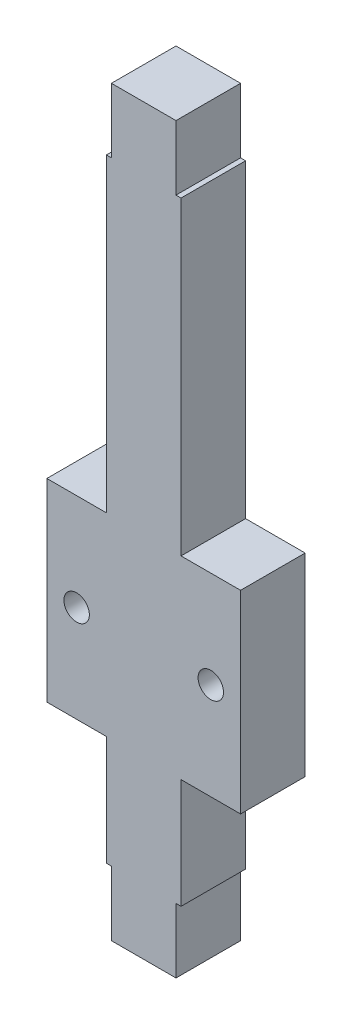
ISO-10303-21;
HEADER;
FILE_DESCRIPTION(('STEP AP214'),'2;1');
FILE_NAME('part.step','',(''),(''),'','','');
FILE_SCHEMA(('AUTOMOTIVE_DESIGN { 1 0 10303 214 1 1 1 1 }'));
ENDSEC;
DATA;
#1=APPLICATION_CONTEXT('core data for automotive mechanical design processes');
#2=APPLICATION_PROTOCOL_DEFINITION('international standard','automotive_design',2000,#1);
#3=PRODUCT_CONTEXT('',#1,'mechanical');
#4=PRODUCT('Part','Part','',(#3));
#5=PRODUCT_RELATED_PRODUCT_CATEGORY('part','',(#4));
#6=PRODUCT_DEFINITION_FORMATION('','',#4);
#7=PRODUCT_DEFINITION_CONTEXT('part definition',#1,'design');
#8=PRODUCT_DEFINITION('design','',#6,#7);
#9=PRODUCT_DEFINITION_SHAPE('','',#8);
#10=(LENGTH_UNIT() NAMED_UNIT(*) SI_UNIT(.MILLI.,.METRE.));
#11=(NAMED_UNIT(*) PLANE_ANGLE_UNIT() SI_UNIT($,.RADIAN.));
#12=(NAMED_UNIT(*) SI_UNIT($,.STERADIAN.) SOLID_ANGLE_UNIT());
#13=UNCERTAINTY_MEASURE_WITH_UNIT(LENGTH_MEASURE(1.E-05),#10,'distance_accuracy_value','');
#14=(GEOMETRIC_REPRESENTATION_CONTEXT(3) GLOBAL_UNCERTAINTY_ASSIGNED_CONTEXT((#13)) GLOBAL_UNIT_ASSIGNED_CONTEXT((#10,
#11,#12)) REPRESENTATION_CONTEXT('',''));
#15=CARTESIAN_POINT('',(0.,0.,0.));
#16=DIRECTION('',(0.,0.,1.));
#17=DIRECTION('',(1.,0.,0.));
#18=AXIS2_PLACEMENT_3D('',#15,#16,#17);
#19=CARTESIAN_POINT('',(0.,0.,6.35));
#20=DIRECTION('',(0.,-1.,0.));
#21=DIRECTION('',(0.,0.,-1.));
#22=AXIS2_PLACEMENT_3D('',#19,#20,#21);
#23=PLANE('',#22);
#24=DIRECTION('',(-1.,0.,0.));
#25=VECTOR('',#24,1.);
#26=CARTESIAN_POINT('',(0.,0.,0.));
#27=LINE('',#26,#25);
#28=CARTESIAN_POINT('',(6.8453,0.,0.));
#29=VERTEX_POINT('',#28);
#30=CARTESIAN_POINT('',(6.35,0.,0.));
#31=VERTEX_POINT('',#30);
#32=EDGE_CURVE('E200',#29,#31,#27,.T.);
#33=ORIENTED_EDGE('',*,*,#32,.F.);
#34=DIRECTION('',(0.,0.,-1.));
#35=VECTOR('',#34,1.);
#36=CARTESIAN_POINT('',(6.8453,0.,6.35));
#37=LINE('',#36,#35);
#38=CARTESIAN_POINT('',(6.8453,0.,6.35));
#39=VERTEX_POINT('',#38);
#40=EDGE_CURVE('E11',#39,#29,#37,.T.);
#41=ORIENTED_EDGE('',*,*,#40,.F.);
#42=DIRECTION('',(-1.,0.,0.));
#43=VECTOR('',#42,1.);
#44=CARTESIAN_POINT('',(0.,0.,6.35));
#45=LINE('',#44,#43);
#46=CARTESIAN_POINT('',(6.35,0.,6.35));
#47=VERTEX_POINT('',#46);
#48=EDGE_CURVE('E253',#39,#47,#45,.T.);
#49=ORIENTED_EDGE('',*,*,#48,.T.);
#50=DIRECTION('',(0.,0.,-1.));
#51=VECTOR('',#50,1.);
#52=CARTESIAN_POINT('',(6.35,0.,6.35));
#53=LINE('',#52,#51);
#54=EDGE_CURVE('E121',#47,#31,#53,.T.);
#55=ORIENTED_EDGE('',*,*,#54,.T.);
#56=EDGE_LOOP('',(#33,#41,#49,#55));
#57=FACE_BOUND('',#56,.T.);
#58=ADVANCED_FACE('F35',(#57),#23,.T.);
#59=CARTESIAN_POINT('',(6.8453,0.,6.35));
#60=DIRECTION('',(1.,0.,0.));
#61=DIRECTION('',(0.,0.,-1.));
#62=AXIS2_PLACEMENT_3D('',#59,#60,#61);
#63=PLANE('',#62);
#64=DIRECTION('',(0.,-1.,0.));
#65=VECTOR('',#64,1.);
#66=CARTESIAN_POINT('',(6.8453,0.,0.));
#67=LINE('',#66,#65);
#68=CARTESIAN_POINT('',(6.8453,10.795,0.));
#69=VERTEX_POINT('',#68);
#70=EDGE_CURVE('E203',#69,#29,#67,.T.);
#71=ORIENTED_EDGE('',*,*,#70,.F.);
#72=DIRECTION('',(0.,0.,-1.));
#73=VECTOR('',#72,1.);
#74=CARTESIAN_POINT('',(6.8453,10.795,6.35));
#75=LINE('',#74,#73);
#76=CARTESIAN_POINT('',(6.8453,10.795,6.35));
#77=VERTEX_POINT('',#76);
#78=EDGE_CURVE('E43',#77,#69,#75,.T.);
#79=ORIENTED_EDGE('',*,*,#78,.F.);
#80=DIRECTION('',(0.,-1.,0.));
#81=VECTOR('',#80,1.);
#82=CARTESIAN_POINT('',(6.8453,0.,6.35));
#83=LINE('',#82,#81);
#84=EDGE_CURVE('E301',#77,#39,#83,.T.);
#85=ORIENTED_EDGE('',*,*,#84,.T.);
#86=ORIENTED_EDGE('',*,*,#40,.T.);
#87=EDGE_LOOP('',(#71,#79,#85,#86));
#88=FACE_BOUND('',#87,.T.);
#89=ADVANCED_FACE('F300',(#88),#63,.T.);
#90=CARTESIAN_POINT('',(0.,10.795,6.35));
#91=DIRECTION('',(0.,1.,0.));
#92=DIRECTION('',(-1.,0.,0.));
#93=AXIS2_PLACEMENT_3D('',#90,#91,#92);
#94=PLANE('',#93);
#95=DIRECTION('',(1.,0.,0.));
#96=VECTOR('',#95,1.);
#97=CARTESIAN_POINT('',(0.,10.795,0.));
#98=LINE('',#97,#96);
#99=CARTESIAN_POINT('',(12.7,10.795,0.));
#100=VERTEX_POINT('',#99);
#101=EDGE_CURVE('E207',#69,#100,#98,.T.);
#102=ORIENTED_EDGE('',*,*,#101,.T.);
#103=DIRECTION('',(0.,0.,-1.));
#104=VECTOR('',#103,1.);
#105=CARTESIAN_POINT('',(12.7,10.795,6.35));
#106=LINE('',#105,#104);
#107=CARTESIAN_POINT('',(12.7,10.795,6.35));
#108=VERTEX_POINT('',#107);
#109=EDGE_CURVE('E286',#108,#100,#106,.T.);
#110=ORIENTED_EDGE('',*,*,#109,.F.);
#111=DIRECTION('',(1.,0.,0.));
#112=VECTOR('',#111,1.);
#113=CARTESIAN_POINT('',(0.,10.795,6.35));
#114=LINE('',#113,#112);
#115=EDGE_CURVE('E292',#77,#108,#114,.T.);
#116=ORIENTED_EDGE('',*,*,#115,.F.);
#117=ORIENTED_EDGE('',*,*,#78,.T.);
#118=EDGE_LOOP('',(#102,#110,#116,#117));
#119=FACE_BOUND('',#118,.T.);
#120=ADVANCED_FACE('F290',(#119),#94,.F.);
#121=CARTESIAN_POINT('',(12.7,0.,6.35));
#122=DIRECTION('',(1.,0.,0.));
#123=DIRECTION('',(0.,1.,0.));
#124=AXIS2_PLACEMENT_3D('',#121,#122,#123);
#125=PLANE('',#124);
#126=DIRECTION('',(0.,-1.,0.));
#127=VECTOR('',#126,1.);
#128=CARTESIAN_POINT('',(12.7,0.,0.));
#129=LINE('',#128,#127);
#130=CARTESIAN_POINT('',(12.7,29.845,0.));
#131=VERTEX_POINT('',#130);
#132=EDGE_CURVE('E210',#131,#100,#129,.T.);
#133=ORIENTED_EDGE('',*,*,#132,.F.);
#134=DIRECTION('',(0.,0.,-1.));
#135=VECTOR('',#134,1.);
#136=CARTESIAN_POINT('',(12.7,29.845,6.35));
#137=LINE('',#136,#135);
#138=CARTESIAN_POINT('',(12.7,29.845,6.35));
#139=VERTEX_POINT('',#138);
#140=EDGE_CURVE('E284',#139,#131,#137,.T.);
#141=ORIENTED_EDGE('',*,*,#140,.F.);
#142=DIRECTION('',(0.,-1.,0.));
#143=VECTOR('',#142,1.);
#144=CARTESIAN_POINT('',(12.7,0.,6.35));
#145=LINE('',#144,#143);
#146=EDGE_CURVE('E312',#139,#108,#145,.T.);
#147=ORIENTED_EDGE('',*,*,#146,.T.);
#148=ORIENTED_EDGE('',*,*,#109,.T.);
#149=EDGE_LOOP('',(#133,#141,#147,#148));
#150=FACE_BOUND('',#149,.T.);
#151=ADVANCED_FACE('F400',(#150),#125,.T.);
#152=CARTESIAN_POINT('',(0.,29.845,6.35));
#153=DIRECTION('',(0.,1.,0.));
#154=DIRECTION('',(0.,0.,1.));
#155=AXIS2_PLACEMENT_3D('',#152,#153,#154);
#156=PLANE('',#155);
#157=DIRECTION('',(1.,0.,0.));
#158=VECTOR('',#157,1.);
#159=CARTESIAN_POINT('',(0.,29.845,0.));
#160=LINE('',#159,#158);
#161=CARTESIAN_POINT('',(6.8453,29.845,0.));
#162=VERTEX_POINT('',#161);
#163=EDGE_CURVE('E213',#162,#131,#160,.T.);
#164=ORIENTED_EDGE('',*,*,#163,.F.);
#165=DIRECTION('',(0.,0.,-1.));
#166=VECTOR('',#165,1.);
#167=CARTESIAN_POINT('',(6.8453,29.845,6.35));
#168=LINE('',#167,#166);
#169=CARTESIAN_POINT('',(6.8453,29.845,6.35));
#170=VERTEX_POINT('',#169);
#171=EDGE_CURVE('E282',#170,#162,#168,.T.);
#172=ORIENTED_EDGE('',*,*,#171,.F.);
#173=DIRECTION('',(1.,0.,0.));
#174=VECTOR('',#173,1.);
#175=CARTESIAN_POINT('',(0.,29.845,6.35));
#176=LINE('',#175,#174);
#177=EDGE_CURVE('E315',#170,#139,#176,.T.);
#178=ORIENTED_EDGE('',*,*,#177,.T.);
#179=ORIENTED_EDGE('',*,*,#140,.T.);
#180=EDGE_LOOP('',(#164,#172,#178,#179));
#181=FACE_BOUND('',#180,.T.);
#182=ADVANCED_FACE('F397',(#181),#156,.T.);
#183=CARTESIAN_POINT('',(6.8453,0.,6.35));
#184=DIRECTION('',(1.,0.,0.));
#185=DIRECTION('',(0.,0.,-1.));
#186=AXIS2_PLACEMENT_3D('',#183,#184,#185);
#187=PLANE('',#186);
#188=DIRECTION('',(0.,-1.,0.));
#189=VECTOR('',#188,1.);
#190=CARTESIAN_POINT('',(6.8453,0.,0.));
#191=LINE('',#190,#189);
#192=CARTESIAN_POINT('',(6.8453,60.325,0.));
#193=VERTEX_POINT('',#192);
#194=EDGE_CURVE('E216',#193,#162,#191,.T.);
#195=ORIENTED_EDGE('',*,*,#194,.F.);
#196=DIRECTION('',(0.,0.,-1.));
#197=VECTOR('',#196,1.);
#198=CARTESIAN_POINT('',(6.8453,60.325,6.35));
#199=LINE('',#198,#197);
#200=CARTESIAN_POINT('',(6.8453,60.325,6.35));
#201=VERTEX_POINT('',#200);
#202=EDGE_CURVE('E280',#201,#193,#199,.T.);
#203=ORIENTED_EDGE('',*,*,#202,.F.);
#204=DIRECTION('',(0.,-1.,0.));
#205=VECTOR('',#204,1.);
#206=CARTESIAN_POINT('',(6.8453,0.,6.35));
#207=LINE('',#206,#205);
#208=EDGE_CURVE('E318',#201,#170,#207,.T.);
#209=ORIENTED_EDGE('',*,*,#208,.T.);
#210=ORIENTED_EDGE('',*,*,#171,.T.);
#211=EDGE_LOOP('',(#195,#203,#209,#210));
#212=FACE_BOUND('',#211,.T.);
#213=ADVANCED_FACE('F393',(#212),#187,.T.);
#214=CARTESIAN_POINT('',(8.45121693424602E-13,60.3250000000001,6.35));
#215=DIRECTION('',(0.,1.,0.));
#216=DIRECTION('',(-1.,0.,0.));
#217=AXIS2_PLACEMENT_3D('',#214,#215,#216);
#218=PLANE('',#217);
#219=DIRECTION('',(1.,0.,0.));
#220=VECTOR('',#219,1.);
#221=CARTESIAN_POINT('',(8.45121693424602E-13,60.3250000000001,0.));
#222=LINE('',#221,#220);
#223=CARTESIAN_POINT('',(6.35,60.325,0.));
#224=VERTEX_POINT('',#223);
#225=EDGE_CURVE('E219',#224,#193,#222,.T.);
#226=ORIENTED_EDGE('',*,*,#225,.F.);
#227=DIRECTION('',(0.,0.,-1.));
#228=VECTOR('',#227,1.);
#229=CARTESIAN_POINT('',(6.35,60.325,6.35));
#230=LINE('',#229,#228);
#231=CARTESIAN_POINT('',(6.35,60.325,6.35));
#232=VERTEX_POINT('',#231);
#233=EDGE_CURVE('E278',#232,#224,#230,.T.);
#234=ORIENTED_EDGE('',*,*,#233,.F.);
#235=DIRECTION('',(1.,0.,0.));
#236=VECTOR('',#235,1.);
#237=CARTESIAN_POINT('',(8.45121693424602E-13,60.3250000000001,6.35));
#238=LINE('',#237,#236);
#239=EDGE_CURVE('E321',#232,#201,#238,.T.);
#240=ORIENTED_EDGE('',*,*,#239,.T.);
#241=ORIENTED_EDGE('',*,*,#202,.T.);
#242=EDGE_LOOP('',(#226,#234,#240,#241));
#243=FACE_BOUND('',#242,.T.);
#244=ADVANCED_FACE('F389',(#243),#218,.T.);
#245=CARTESIAN_POINT('',(6.35,0.,6.35));
#246=DIRECTION('',(1.,0.,0.));
#247=DIRECTION('',(0.,0.,-1.));
#248=AXIS2_PLACEMENT_3D('',#245,#246,#247);
#249=PLANE('',#248);
#250=DIRECTION('',(0.,-1.,0.));
#251=VECTOR('',#250,1.);
#252=CARTESIAN_POINT('',(6.35,0.,0.));
#253=LINE('',#252,#251);
#254=CARTESIAN_POINT('',(6.35,66.675,0.));
#255=VERTEX_POINT('',#254);
#256=EDGE_CURVE('E222',#255,#224,#253,.T.);
#257=ORIENTED_EDGE('',*,*,#256,.F.);
#258=DIRECTION('',(0.,0.,-1.));
#259=VECTOR('',#258,1.);
#260=CARTESIAN_POINT('',(6.35,66.675,6.35));
#261=LINE('',#260,#259);
#262=CARTESIAN_POINT('',(6.35,66.675,6.35));
#263=VERTEX_POINT('',#262);
#264=EDGE_CURVE('E276',#263,#255,#261,.T.);
#265=ORIENTED_EDGE('',*,*,#264,.F.);
#266=DIRECTION('',(0.,-1.,0.));
#267=VECTOR('',#266,1.);
#268=CARTESIAN_POINT('',(6.35,0.,6.35));
#269=LINE('',#268,#267);
#270=EDGE_CURVE('E324',#263,#232,#269,.T.);
#271=ORIENTED_EDGE('',*,*,#270,.T.);
#272=ORIENTED_EDGE('',*,*,#233,.T.);
#273=EDGE_LOOP('',(#257,#265,#271,#272));
#274=FACE_BOUND('',#273,.T.);
#275=ADVANCED_FACE('F385',(#274),#249,.T.);
#276=CARTESIAN_POINT('',(0.,66.675,6.35));
#277=DIRECTION('',(0.,1.,0.));
#278=DIRECTION('',(0.,0.,1.));
#279=AXIS2_PLACEMENT_3D('',#276,#277,#278);
#280=PLANE('',#279);
#281=DIRECTION('',(1.,0.,0.));
#282=VECTOR('',#281,1.);
#283=CARTESIAN_POINT('',(0.,66.675,0.));
#284=LINE('',#283,#282);
#285=CARTESIAN_POINT('',(0.,66.675,0.));
#286=VERTEX_POINT('',#285);
#287=EDGE_CURVE('E225',#286,#255,#284,.T.);
#288=ORIENTED_EDGE('',*,*,#287,.F.);
#289=DIRECTION('',(0.,0.,-1.));
#290=VECTOR('',#289,1.);
#291=CARTESIAN_POINT('',(0.,66.675,6.35));
#292=LINE('',#291,#290);
#293=CARTESIAN_POINT('',(0.,66.675,6.35));
#294=VERTEX_POINT('',#293);
#295=EDGE_CURVE('E274',#294,#286,#292,.T.);
#296=ORIENTED_EDGE('',*,*,#295,.F.);
#297=DIRECTION('',(1.,0.,0.));
#298=VECTOR('',#297,1.);
#299=CARTESIAN_POINT('',(0.,66.675,6.35));
#300=LINE('',#299,#298);
#301=EDGE_CURVE('E327',#294,#263,#300,.T.);
#302=ORIENTED_EDGE('',*,*,#301,.T.);
#303=ORIENTED_EDGE('',*,*,#264,.T.);
#304=EDGE_LOOP('',(#288,#296,#302,#303));
#305=FACE_BOUND('',#304,.T.);
#306=ADVANCED_FACE('F379',(#305),#280,.T.);
#307=CARTESIAN_POINT('',(0.,0.,6.35));
#308=DIRECTION('',(1.,0.,0.));
#309=DIRECTION('',(0.,0.,-1.));
#310=AXIS2_PLACEMENT_3D('',#307,#308,#309);
#311=PLANE('',#310);
#312=DIRECTION('',(0.,-1.,0.));
#313=VECTOR('',#312,1.);
#314=CARTESIAN_POINT('',(0.,0.,0.));
#315=LINE('',#314,#313);
#316=CARTESIAN_POINT('',(0.,60.325,0.));
#317=VERTEX_POINT('',#316);
#318=EDGE_CURVE('E228',#286,#317,#315,.T.);
#319=ORIENTED_EDGE('',*,*,#318,.T.);
#320=DIRECTION('',(0.,0.,-1.));
#321=VECTOR('',#320,1.);
#322=CARTESIAN_POINT('',(0.,60.325,6.35));
#323=LINE('',#322,#321);
#324=CARTESIAN_POINT('',(0.,60.325,6.35));
#325=VERTEX_POINT('',#324);
#326=EDGE_CURVE('E272',#325,#317,#323,.T.);
#327=ORIENTED_EDGE('',*,*,#326,.F.);
#328=DIRECTION('',(0.,-1.,0.));
#329=VECTOR('',#328,1.);
#330=CARTESIAN_POINT('',(0.,0.,6.35));
#331=LINE('',#330,#329);
#332=EDGE_CURVE('E330',#294,#325,#331,.T.);
#333=ORIENTED_EDGE('',*,*,#332,.F.);
#334=ORIENTED_EDGE('',*,*,#295,.T.);
#335=EDGE_LOOP('',(#319,#327,#333,#334));
#336=FACE_BOUND('',#335,.T.);
#337=ADVANCED_FACE('F401',(#336),#311,.F.);
#338=CARTESIAN_POINT('',(0.,60.325,6.35));
#339=DIRECTION('',(0.,1.,0.));
#340=DIRECTION('',(0.,0.,1.));
#341=AXIS2_PLACEMENT_3D('',#338,#339,#340);
#342=PLANE('',#341);
#343=DIRECTION('',(1.,0.,0.));
#344=VECTOR('',#343,1.);
#345=CARTESIAN_POINT('',(0.,60.325,0.));
#346=LINE('',#345,#344);
#347=CARTESIAN_POINT('',(-0.495299999999999,60.325,0.));
#348=VERTEX_POINT('',#347);
#349=EDGE_CURVE('E231',#348,#317,#346,.T.);
#350=ORIENTED_EDGE('',*,*,#349,.F.);
#351=DIRECTION('',(0.,0.,-1.));
#352=VECTOR('',#351,1.);
#353=CARTESIAN_POINT('',(-0.495299999999999,60.325,6.35));
#354=LINE('',#353,#352);
#355=CARTESIAN_POINT('',(-0.495299999999999,60.325,6.35));
#356=VERTEX_POINT('',#355);
#357=EDGE_CURVE('E270',#356,#348,#354,.T.);
#358=ORIENTED_EDGE('',*,*,#357,.F.);
#359=DIRECTION('',(1.,0.,0.));
#360=VECTOR('',#359,1.);
#361=CARTESIAN_POINT('',(0.,60.325,6.35));
#362=LINE('',#361,#360);
#363=EDGE_CURVE('E332',#356,#325,#362,.T.);
#364=ORIENTED_EDGE('',*,*,#363,.T.);
#365=ORIENTED_EDGE('',*,*,#326,.T.);
#366=EDGE_LOOP('',(#350,#358,#364,#365));
#367=FACE_BOUND('',#366,.T.);
#368=ADVANCED_FACE('F373',(#367),#342,.T.);
#369=CARTESIAN_POINT('',(-0.495299999999999,0.,6.35));
#370=DIRECTION('',(1.,0.,0.));
#371=DIRECTION('',(0.,0.,-1.));
#372=AXIS2_PLACEMENT_3D('',#369,#370,#371);
#373=PLANE('',#372);
#374=DIRECTION('',(0.,-1.,0.));
#375=VECTOR('',#374,1.);
#376=CARTESIAN_POINT('',(-0.495299999999999,0.,0.));
#377=LINE('',#376,#375);
#378=CARTESIAN_POINT('',(-0.495299999999999,29.845,0.));
#379=VERTEX_POINT('',#378);
#380=EDGE_CURVE('E234',#348,#379,#377,.T.);
#381=ORIENTED_EDGE('',*,*,#380,.T.);
#382=DIRECTION('',(0.,0.,-1.));
#383=VECTOR('',#382,1.);
#384=CARTESIAN_POINT('',(-0.495299999999999,29.845,6.35));
#385=LINE('',#384,#383);
#386=CARTESIAN_POINT('',(-0.495299999999999,29.845,6.35));
#387=VERTEX_POINT('',#386);
#388=EDGE_CURVE('E267',#387,#379,#385,.T.);
#389=ORIENTED_EDGE('',*,*,#388,.F.);
#390=DIRECTION('',(0.,-1.,0.));
#391=VECTOR('',#390,1.);
#392=CARTESIAN_POINT('',(-0.495299999999999,0.,6.35));
#393=LINE('',#392,#391);
#394=EDGE_CURVE('E335',#356,#387,#393,.T.);
#395=ORIENTED_EDGE('',*,*,#394,.F.);
#396=ORIENTED_EDGE('',*,*,#357,.T.);
#397=EDGE_LOOP('',(#381,#389,#395,#396));
#398=FACE_BOUND('',#397,.T.);
#399=ADVANCED_FACE('F370',(#398),#373,.F.);
#400=CARTESIAN_POINT('',(0.,29.845,6.35));
#401=DIRECTION('',(0.,-1.,0.));
#402=DIRECTION('',(0.,0.,-1.));
#403=AXIS2_PLACEMENT_3D('',#400,#401,#402);
#404=PLANE('',#403);
#405=DIRECTION('',(-1.,0.,0.));
#406=VECTOR('',#405,1.);
#407=CARTESIAN_POINT('',(0.,29.845,0.));
#408=LINE('',#407,#406);
#409=CARTESIAN_POINT('',(-6.35,29.845,0.));
#410=VERTEX_POINT('',#409);
#411=EDGE_CURVE('E236',#379,#410,#408,.T.);
#412=ORIENTED_EDGE('',*,*,#411,.T.);
#413=DIRECTION('',(0.,0.,-1.));
#414=VECTOR('',#413,1.);
#415=CARTESIAN_POINT('',(-6.35,29.845,6.35));
#416=LINE('',#415,#414);
#417=CARTESIAN_POINT('',(-6.35,29.845,6.35));
#418=VERTEX_POINT('',#417);
#419=EDGE_CURVE('E264',#418,#410,#416,.T.);
#420=ORIENTED_EDGE('',*,*,#419,.F.);
#421=DIRECTION('',(-1.,0.,0.));
#422=VECTOR('',#421,1.);
#423=CARTESIAN_POINT('',(0.,29.845,6.35));
#424=LINE('',#423,#422);
#425=EDGE_CURVE('E337',#387,#418,#424,.T.);
#426=ORIENTED_EDGE('',*,*,#425,.F.);
#427=ORIENTED_EDGE('',*,*,#388,.T.);
#428=EDGE_LOOP('',(#412,#420,#426,#427));
#429=FACE_BOUND('',#428,.T.);
#430=ADVANCED_FACE('F365',(#429),#404,.F.);
#431=CARTESIAN_POINT('',(-6.34999999999999,0.,6.35));
#432=DIRECTION('',(1.,0.,0.));
#433=DIRECTION('',(0.,1.,0.));
#434=AXIS2_PLACEMENT_3D('',#431,#432,#433);
#435=PLANE('',#434);
#436=DIRECTION('',(0.,-1.,0.));
#437=VECTOR('',#436,1.);
#438=CARTESIAN_POINT('',(-6.34999999999999,0.,0.));
#439=LINE('',#438,#437);
#440=CARTESIAN_POINT('',(-6.35,10.795,0.));
#441=VERTEX_POINT('',#440);
#442=EDGE_CURVE('E238',#410,#441,#439,.T.);
#443=ORIENTED_EDGE('',*,*,#442,.T.);
#444=DIRECTION('',(0.,0.,-1.));
#445=VECTOR('',#444,1.);
#446=CARTESIAN_POINT('',(-6.35,10.795,6.35));
#447=LINE('',#446,#445);
#448=CARTESIAN_POINT('',(-6.35,10.795,6.35));
#449=VERTEX_POINT('',#448);
#450=EDGE_CURVE('E262',#449,#441,#447,.T.);
#451=ORIENTED_EDGE('',*,*,#450,.F.);
#452=DIRECTION('',(0.,-1.,0.));
#453=VECTOR('',#452,1.);
#454=CARTESIAN_POINT('',(-6.34999999999999,0.,6.35));
#455=LINE('',#454,#453);
#456=EDGE_CURVE('E339',#418,#449,#455,.T.);
#457=ORIENTED_EDGE('',*,*,#456,.F.);
#458=ORIENTED_EDGE('',*,*,#419,.T.);
#459=EDGE_LOOP('',(#443,#451,#457,#458));
#460=FACE_BOUND('',#459,.T.);
#461=ADVANCED_FACE('F359',(#460),#435,.F.);
#462=CARTESIAN_POINT('',(0.,10.795,6.35));
#463=DIRECTION('',(0.,-1.,0.));
#464=DIRECTION('',(1.,0.,0.));
#465=AXIS2_PLACEMENT_3D('',#462,#463,#464);
#466=PLANE('',#465);
#467=DIRECTION('',(-1.,0.,0.));
#468=VECTOR('',#467,1.);
#469=CARTESIAN_POINT('',(0.,10.795,0.));
#470=LINE('',#469,#468);
#471=CARTESIAN_POINT('',(-0.495299999999999,10.795,0.));
#472=VERTEX_POINT('',#471);
#473=EDGE_CURVE('E241',#472,#441,#470,.T.);
#474=ORIENTED_EDGE('',*,*,#473,.F.);
#475=DIRECTION('',(0.,0.,-1.));
#476=VECTOR('',#475,1.);
#477=CARTESIAN_POINT('',(-0.495299999999999,10.795,6.35));
#478=LINE('',#477,#476);
#479=CARTESIAN_POINT('',(-0.495299999999999,10.795,6.35));
#480=VERTEX_POINT('',#479);
#481=EDGE_CURVE('E260',#480,#472,#478,.T.);
#482=ORIENTED_EDGE('',*,*,#481,.F.);
#483=DIRECTION('',(-1.,0.,0.));
#484=VECTOR('',#483,1.);
#485=CARTESIAN_POINT('',(0.,10.795,6.35));
#486=LINE('',#485,#484);
#487=EDGE_CURVE('E341',#480,#449,#486,.T.);
#488=ORIENTED_EDGE('',*,*,#487,.T.);
#489=ORIENTED_EDGE('',*,*,#450,.T.);
#490=EDGE_LOOP('',(#474,#482,#488,#489));
#491=FACE_BOUND('',#490,.T.);
#492=ADVANCED_FACE('F355',(#491),#466,.T.);
#493=CARTESIAN_POINT('',(-0.495299999999999,0.,6.35));
#494=DIRECTION('',(1.,0.,0.));
#495=DIRECTION('',(0.,0.,-1.));
#496=AXIS2_PLACEMENT_3D('',#493,#494,#495);
#497=PLANE('',#496);
#498=DIRECTION('',(0.,-1.,0.));
#499=VECTOR('',#498,1.);
#500=CARTESIAN_POINT('',(-0.495299999999999,0.,0.));
#501=LINE('',#500,#499);
#502=CARTESIAN_POINT('',(-0.495299999999999,0.,0.));
#503=VERTEX_POINT('',#502);
#504=EDGE_CURVE('E244',#472,#503,#501,.T.);
#505=ORIENTED_EDGE('',*,*,#504,.T.);
#506=DIRECTION('',(0.,0.,-1.));
#507=VECTOR('',#506,1.);
#508=CARTESIAN_POINT('',(-0.495299999999999,0.,6.35));
#509=LINE('',#508,#507);
#510=CARTESIAN_POINT('',(-0.495299999999999,0.,6.35));
#511=VERTEX_POINT('',#510);
#512=EDGE_CURVE('E257',#511,#503,#509,.T.);
#513=ORIENTED_EDGE('',*,*,#512,.F.);
#514=DIRECTION('',(0.,-1.,0.));
#515=VECTOR('',#514,1.);
#516=CARTESIAN_POINT('',(-0.495299999999999,0.,6.35));
#517=LINE('',#516,#515);
#518=EDGE_CURVE('E195',#480,#511,#517,.T.);
#519=ORIENTED_EDGE('',*,*,#518,.F.);
#520=ORIENTED_EDGE('',*,*,#481,.T.);
#521=EDGE_LOOP('',(#505,#513,#519,#520));
#522=FACE_BOUND('',#521,.T.);
#523=ADVANCED_FACE('F347',(#522),#497,.F.);
#524=CARTESIAN_POINT('',(0.,0.,6.35));
#525=DIRECTION('',(0.,1.,0.));
#526=DIRECTION('',(0.,0.,1.));
#527=AXIS2_PLACEMENT_3D('',#524,#525,#526);
#528=PLANE('',#527);
#529=DIRECTION('',(1.,0.,0.));
#530=VECTOR('',#529,1.);
#531=CARTESIAN_POINT('',(0.,0.,0.));
#532=LINE('',#531,#530);
#533=CARTESIAN_POINT('',(0.,0.,0.));
#534=VERTEX_POINT('',#533);
#535=EDGE_CURVE('E246',#503,#534,#532,.T.);
#536=ORIENTED_EDGE('',*,*,#535,.T.);
#537=DIRECTION('',(0.,0.,-1.));
#538=VECTOR('',#537,1.);
#539=CARTESIAN_POINT('',(0.,0.,6.35));
#540=LINE('',#539,#538);
#541=CARTESIAN_POINT('',(0.,0.,6.35));
#542=VERTEX_POINT('',#541);
#543=EDGE_CURVE('E184',#542,#534,#540,.T.);
#544=ORIENTED_EDGE('',*,*,#543,.F.);
#545=DIRECTION('',(1.,0.,0.));
#546=VECTOR('',#545,1.);
#547=CARTESIAN_POINT('',(0.,0.,6.35));
#548=LINE('',#547,#546);
#549=EDGE_CURVE('E192',#511,#542,#548,.T.);
#550=ORIENTED_EDGE('',*,*,#549,.F.);
#551=ORIENTED_EDGE('',*,*,#512,.T.);
#552=EDGE_LOOP('',(#536,#544,#550,#551));
#553=FACE_BOUND('',#552,.T.);
#554=ADVANCED_FACE('F351',(#553),#528,.F.);
#555=CARTESIAN_POINT('',(0.,0.,6.35));
#556=DIRECTION('',(-1.,0.,0.));
#557=DIRECTION('',(0.,0.,1.));
#558=AXIS2_PLACEMENT_3D('',#555,#556,#557);
#559=PLANE('',#558);
#560=DIRECTION('',(0.,1.,0.));
#561=VECTOR('',#560,1.);
#562=CARTESIAN_POINT('',(0.,0.,0.));
#563=LINE('',#562,#561);
#564=CARTESIAN_POINT('',(0.,-6.34999999999999,0.));
#565=VERTEX_POINT('',#564);
#566=EDGE_CURVE('E183',#565,#534,#563,.T.);
#567=ORIENTED_EDGE('',*,*,#566,.F.);
#568=DIRECTION('',(0.,0.,-1.));
#569=VECTOR('',#568,1.);
#570=CARTESIAN_POINT('',(0.,-6.34999999999999,6.35));
#571=LINE('',#570,#569);
#572=CARTESIAN_POINT('',(0.,-6.34999999999999,6.35));
#573=VERTEX_POINT('',#572);
#574=EDGE_CURVE('E177',#573,#565,#571,.T.);
#575=ORIENTED_EDGE('',*,*,#574,.F.);
#576=DIRECTION('',(0.,1.,0.));
#577=VECTOR('',#576,1.);
#578=CARTESIAN_POINT('',(0.,0.,6.35));
#579=LINE('',#578,#577);
#580=EDGE_CURVE('E181',#573,#542,#579,.T.);
#581=ORIENTED_EDGE('',*,*,#580,.T.);
#582=ORIENTED_EDGE('',*,*,#543,.T.);
#583=EDGE_LOOP('',(#567,#575,#581,#582));
#584=FACE_BOUND('',#583,.T.);
#585=ADVANCED_FACE('F179',(#584),#559,.T.);
#586=CARTESIAN_POINT('',(0.,-6.34999999999999,6.35));
#587=DIRECTION('',(0.,1.,0.));
#588=DIRECTION('',(0.,0.,1.));
#589=AXIS2_PLACEMENT_3D('',#586,#587,#588);
#590=PLANE('',#589);
#591=DIRECTION('',(1.,0.,0.));
#592=VECTOR('',#591,1.);
#593=CARTESIAN_POINT('',(0.,-6.34999999999999,0.));
#594=LINE('',#593,#592);
#595=CARTESIAN_POINT('',(6.35,-6.34999999999999,0.));
#596=VERTEX_POINT('',#595);
#597=EDGE_CURVE('E114',#565,#596,#594,.T.);
#598=ORIENTED_EDGE('',*,*,#597,.T.);
#599=DIRECTION('',(0.,0.,-1.));
#600=VECTOR('',#599,1.);
#601=CARTESIAN_POINT('',(6.35,-6.34999999999999,6.35));
#602=LINE('',#601,#600);
#603=CARTESIAN_POINT('',(6.35,-6.34999999999999,6.35));
#604=VERTEX_POINT('',#603);
#605=EDGE_CURVE('E185',#604,#596,#602,.T.);
#606=ORIENTED_EDGE('',*,*,#605,.F.);
#607=DIRECTION('',(1.,0.,0.));
#608=VECTOR('',#607,1.);
#609=CARTESIAN_POINT('',(0.,-6.34999999999999,6.35));
#610=LINE('',#609,#608);
#611=EDGE_CURVE('E187',#573,#604,#610,.T.);
#612=ORIENTED_EDGE('',*,*,#611,.F.);
#613=ORIENTED_EDGE('',*,*,#574,.T.);
#614=EDGE_LOOP('',(#598,#606,#612,#613));
#615=FACE_BOUND('',#614,.T.);
#616=ADVANCED_FACE('F188',(#615),#590,.F.);
#617=CARTESIAN_POINT('',(6.35,0.,6.35));
#618=DIRECTION('',(-1.,0.,0.));
#619=DIRECTION('',(0.,0.,1.));
#620=AXIS2_PLACEMENT_3D('',#617,#618,#619);
#621=PLANE('',#620);
#622=DIRECTION('',(0.,1.,0.));
#623=VECTOR('',#622,1.);
#624=CARTESIAN_POINT('',(6.35,0.,0.));
#625=LINE('',#624,#623);
#626=EDGE_CURVE('E251',#596,#31,#625,.T.);
#627=ORIENTED_EDGE('',*,*,#626,.T.);
#628=ORIENTED_EDGE('',*,*,#54,.F.);
#629=DIRECTION('',(0.,1.,0.));
#630=VECTOR('',#629,1.);
#631=CARTESIAN_POINT('',(6.35,0.,6.35));
#632=LINE('',#631,#630);
#633=EDGE_CURVE('E51',#604,#47,#632,.T.);
#634=ORIENTED_EDGE('',*,*,#633,.F.);
#635=ORIENTED_EDGE('',*,*,#605,.T.);
#636=EDGE_LOOP('',(#627,#628,#634,#635));
#637=FACE_BOUND('',#636,.T.);
#638=ADVANCED_FACE('F304',(#637),#621,.F.);
#639=CARTESIAN_POINT('',(0.,0.,6.35));
#640=DIRECTION('',(0.,0.,1.));
#641=DIRECTION('',(1.,0.,0.));
#642=AXIS2_PLACEMENT_3D('',#639,#640,#641);
#643=PLANE('',#642);
#644=CARTESIAN_POINT('',(9.77265,20.32,6.35));
#645=DIRECTION('',(0.,0.,1.));
#646=DIRECTION('',(1.,0.,0.));
#647=AXIS2_PLACEMENT_3D('',#644,#645,#646);
#648=CIRCLE('',#647,1.25);
#649=CARTESIAN_POINT('',(11.02265,20.32,6.35));
#650=VERTEX_POINT('',#649);
#651=EDGE_CURVE('E566',#650,#650,#648,.T.);
#652=ORIENTED_EDGE('',*,*,#651,.F.);
#653=EDGE_LOOP('',(#652));
#654=FACE_BOUND('',#653,.T.);
#655=CARTESIAN_POINT('',(-3.42265,20.32,6.35));
#656=DIRECTION('',(0.,0.,1.));
#657=DIRECTION('',(1.,0.,0.));
#658=AXIS2_PLACEMENT_3D('',#655,#656,#657);
#659=CIRCLE('',#658,1.25);
#660=CARTESIAN_POINT('',(-2.17265,20.32,6.35));
#661=VERTEX_POINT('',#660);
#662=EDGE_CURVE('E308',#661,#661,#659,.T.);
#663=ORIENTED_EDGE('',*,*,#662,.F.);
#664=EDGE_LOOP('',(#663));
#665=FACE_BOUND('',#664,.T.);
#666=ORIENTED_EDGE('',*,*,#48,.F.);
#667=ORIENTED_EDGE('',*,*,#84,.F.);
#668=ORIENTED_EDGE('',*,*,#115,.T.);
#669=ORIENTED_EDGE('',*,*,#146,.F.);
#670=ORIENTED_EDGE('',*,*,#177,.F.);
#671=ORIENTED_EDGE('',*,*,#208,.F.);
#672=ORIENTED_EDGE('',*,*,#239,.F.);
#673=ORIENTED_EDGE('',*,*,#270,.F.);
#674=ORIENTED_EDGE('',*,*,#301,.F.);
#675=ORIENTED_EDGE('',*,*,#332,.T.);
#676=ORIENTED_EDGE('',*,*,#363,.F.);
#677=ORIENTED_EDGE('',*,*,#394,.T.);
#678=ORIENTED_EDGE('',*,*,#425,.T.);
#679=ORIENTED_EDGE('',*,*,#456,.T.);
#680=ORIENTED_EDGE('',*,*,#487,.F.);
#681=ORIENTED_EDGE('',*,*,#518,.T.);
#682=ORIENTED_EDGE('',*,*,#549,.T.);
#683=ORIENTED_EDGE('',*,*,#580,.F.);
#684=ORIENTED_EDGE('',*,*,#611,.T.);
#685=ORIENTED_EDGE('',*,*,#633,.T.);
#686=EDGE_LOOP('',(#666,#667,#668,#669,#670,#671,#672,#673,#674,#675,#676,#677,#678,#679,#680,
#681,#682,#683,#684,#685));
#687=FACE_BOUND('',#686,.T.);
#688=ADVANCED_FACE('F190',(#654,#665,#687),#643,.T.);
#689=CARTESIAN_POINT('',(0.,0.,0.));
#690=DIRECTION('',(0.,0.,1.));
#691=DIRECTION('',(1.,0.,0.));
#692=AXIS2_PLACEMENT_3D('',#689,#690,#691);
#693=PLANE('',#692);
#694=CARTESIAN_POINT('',(9.77265,20.32,0.));
#695=DIRECTION('',(0.,0.,1.));
#696=DIRECTION('',(1.,0.,0.));
#697=AXIS2_PLACEMENT_3D('',#694,#695,#696);
#698=CIRCLE('',#697,1.25);
#699=CARTESIAN_POINT('',(11.02265,20.32,0.));
#700=VERTEX_POINT('',#699);
#701=EDGE_CURVE('E563',#700,#700,#698,.T.);
#702=ORIENTED_EDGE('',*,*,#701,.T.);
#703=EDGE_LOOP('',(#702));
#704=FACE_BOUND('',#703,.T.);
#705=CARTESIAN_POINT('',(-3.42265,20.32,0.));
#706=DIRECTION('',(0.,0.,1.));
#707=DIRECTION('',(1.,0.,0.));
#708=AXIS2_PLACEMENT_3D('',#705,#706,#707);
#709=CIRCLE('',#708,1.25);
#710=CARTESIAN_POINT('',(-2.17265,20.32,0.));
#711=VERTEX_POINT('',#710);
#712=EDGE_CURVE('E204',#711,#711,#709,.T.);
#713=ORIENTED_EDGE('',*,*,#712,.T.);
#714=EDGE_LOOP('',(#713));
#715=FACE_BOUND('',#714,.T.);
#716=ORIENTED_EDGE('',*,*,#32,.T.);
#717=ORIENTED_EDGE('',*,*,#626,.F.);
#718=ORIENTED_EDGE('',*,*,#597,.F.);
#719=ORIENTED_EDGE('',*,*,#566,.T.);
#720=ORIENTED_EDGE('',*,*,#535,.F.);
#721=ORIENTED_EDGE('',*,*,#504,.F.);
#722=ORIENTED_EDGE('',*,*,#473,.T.);
#723=ORIENTED_EDGE('',*,*,#442,.F.);
#724=ORIENTED_EDGE('',*,*,#411,.F.);
#725=ORIENTED_EDGE('',*,*,#380,.F.);
#726=ORIENTED_EDGE('',*,*,#349,.T.);
#727=ORIENTED_EDGE('',*,*,#318,.F.);
#728=ORIENTED_EDGE('',*,*,#287,.T.);
#729=ORIENTED_EDGE('',*,*,#256,.T.);
#730=ORIENTED_EDGE('',*,*,#225,.T.);
#731=ORIENTED_EDGE('',*,*,#194,.T.);
#732=ORIENTED_EDGE('',*,*,#163,.T.);
#733=ORIENTED_EDGE('',*,*,#132,.T.);
#734=ORIENTED_EDGE('',*,*,#101,.F.);
#735=ORIENTED_EDGE('',*,*,#70,.T.);
#736=EDGE_LOOP('',(#716,#717,#718,#719,#720,#721,#722,#723,#724,#725,#726,#727,#728,#729,#730,
#731,#732,#733,#734,#735));
#737=FACE_BOUND('',#736,.T.);
#738=ADVANCED_FACE('F298',(#704,#715,#737),#693,.F.);
#739=CARTESIAN_POINT('',(-3.42265,20.32,0.));
#740=DIRECTION('',(0.,0.,1.));
#741=DIRECTION('',(1.,0.,0.));
#742=AXIS2_PLACEMENT_3D('',#739,#740,#741);
#743=CYLINDRICAL_SURFACE('',#742,1.25);
#744=ORIENTED_EDGE('',*,*,#712,.F.);
#745=EDGE_LOOP('',(#744));
#746=FACE_BOUND('',#745,.T.);
#747=ORIENTED_EDGE('',*,*,#662,.T.);
#748=EDGE_LOOP('',(#747));
#749=FACE_BOUND('',#748,.T.);
#750=ADVANCED_FACE('F536',(#746,#749),#743,.F.);
#751=CARTESIAN_POINT('',(9.77265,20.32,0.));
#752=DIRECTION('',(0.,0.,1.));
#753=DIRECTION('',(1.,0.,0.));
#754=AXIS2_PLACEMENT_3D('',#751,#752,#753);
#755=CYLINDRICAL_SURFACE('',#754,1.25);
#756=ORIENTED_EDGE('',*,*,#701,.F.);
#757=EDGE_LOOP('',(#756));
#758=FACE_BOUND('',#757,.T.);
#759=ORIENTED_EDGE('',*,*,#651,.T.);
#760=EDGE_LOOP('',(#759));
#761=FACE_BOUND('',#760,.T.);
#762=ADVANCED_FACE('F546',(#758,#761),#755,.F.);
#763=CLOSED_SHELL('',(#58,#89,#120,#151,#182,#213,#244,#275,#306,#337,#368,#399,#430,#461,#492,
#523,#554,#585,#616,#638,#688,#738,#750,#762));
#764=MANIFOLD_SOLID_BREP('B2',#763);
#765=ADVANCED_BREP_SHAPE_REPRESENTATION('',(#18,#764),#14);
#766=SHAPE_DEFINITION_REPRESENTATION(#9,#765);
ENDSEC;
END-ISO-10303-21;
